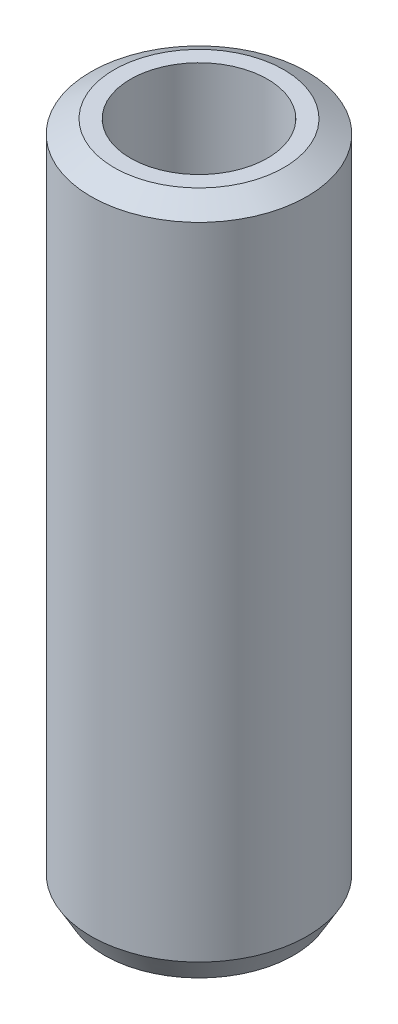
ISO-10303-21;
HEADER;
FILE_DESCRIPTION(('STEP AP214'),'2;1');
FILE_NAME('part.step','',(''),(''),'','','');
FILE_SCHEMA(('AUTOMOTIVE_DESIGN { 1 0 10303 214 1 1 1 1 }'));
ENDSEC;
DATA;
#1=APPLICATION_CONTEXT('core data for automotive mechanical design processes');
#2=APPLICATION_PROTOCOL_DEFINITION('international standard','automotive_design',2000,#1);
#3=PRODUCT_CONTEXT('',#1,'mechanical');
#4=PRODUCT('Part','Part','',(#3));
#5=PRODUCT_RELATED_PRODUCT_CATEGORY('part','',(#4));
#6=PRODUCT_DEFINITION_FORMATION('','',#4);
#7=PRODUCT_DEFINITION_CONTEXT('part definition',#1,'design');
#8=PRODUCT_DEFINITION('design','',#6,#7);
#9=PRODUCT_DEFINITION_SHAPE('','',#8);
#10=(LENGTH_UNIT() NAMED_UNIT(*) SI_UNIT(.MILLI.,.METRE.));
#11=(NAMED_UNIT(*) PLANE_ANGLE_UNIT() SI_UNIT($,.RADIAN.));
#12=(NAMED_UNIT(*) SI_UNIT($,.STERADIAN.) SOLID_ANGLE_UNIT());
#13=UNCERTAINTY_MEASURE_WITH_UNIT(LENGTH_MEASURE(1.E-05),#10,'distance_accuracy_value','');
#14=(GEOMETRIC_REPRESENTATION_CONTEXT(3) GLOBAL_UNCERTAINTY_ASSIGNED_CONTEXT((#13)) GLOBAL_UNIT_ASSIGNED_CONTEXT((#10,
#11,#12)) REPRESENTATION_CONTEXT('',''));
#15=CARTESIAN_POINT('',(0.,0.,0.));
#16=DIRECTION('',(0.,0.,1.));
#17=DIRECTION('',(1.,0.,0.));
#18=AXIS2_PLACEMENT_3D('',#15,#16,#17);
#19=CARTESIAN_POINT('',(0.,140.987925295457,0.));
#20=DIRECTION('',(0.,-1.,0.));
#21=DIRECTION('',(0.,0.,-1.));
#22=AXIS2_PLACEMENT_3D('',#19,#20,#21);
#23=CYLINDRICAL_SURFACE('',#22,22.5);
#24=CARTESIAN_POINT('',(0.,138.199197691897,0.));
#25=DIRECTION('',(0.,1.,0.));
#26=DIRECTION('',(0.,0.,1.));
#27=AXIS2_PLACEMENT_3D('',#24,#25,#26);
#28=CIRCLE('',#27,22.5);
#29=CARTESIAN_POINT('',(0.,138.199197691897,22.5));
#30=VERTEX_POINT('',#29);
#31=EDGE_CURVE('E50',#30,#30,#28,.F.);
#32=ORIENTED_EDGE('',*,*,#31,.T.);
#33=EDGE_LOOP('',(#32));
#34=FACE_BOUND('',#33,.T.);
#35=CARTESIAN_POINT('',(0.,4.83021789783569,0.));
#36=DIRECTION('',(0.,1.,0.));
#37=DIRECTION('',(0.,0.,1.));
#38=AXIS2_PLACEMENT_3D('',#35,#36,#37);
#39=CIRCLE('',#38,22.5);
#40=CARTESIAN_POINT('',(0.,4.83021789783569,22.5));
#41=VERTEX_POINT('',#40);
#42=EDGE_CURVE('E51',#41,#41,#39,.T.);
#43=ORIENTED_EDGE('',*,*,#42,.T.);
#44=EDGE_LOOP('',(#43));
#45=FACE_BOUND('',#44,.T.);
#46=ADVANCED_FACE('F39',(#34,#45),#23,.T.);
#47=CARTESIAN_POINT('',(0.,140.987925295457,0.));
#48=DIRECTION('',(0.,1.,0.));
#49=DIRECTION('',(0.,0.,1.));
#50=AXIS2_PLACEMENT_3D('',#47,#48,#49);
#51=PLANE('',#50);
#52=CARTESIAN_POINT('',(0.,140.987925295457,0.));
#53=DIRECTION('',(0.,1.,0.));
#54=DIRECTION('',(0.,0.,1.));
#55=AXIS2_PLACEMENT_3D('',#52,#53,#54);
#56=CIRCLE('',#55,17.6697821021644);
#57=CARTESIAN_POINT('',(0.,140.987925295457,17.6697821021644));
#58=VERTEX_POINT('',#57);
#59=EDGE_CURVE('E54',#58,#58,#56,.T.);
#60=ORIENTED_EDGE('',*,*,#59,.T.);
#61=EDGE_LOOP('',(#60));
#62=FACE_BOUND('',#61,.T.);
#63=CARTESIAN_POINT('',(0.,140.987925295457,0.));
#64=DIRECTION('',(0.,1.,0.));
#65=DIRECTION('',(0.,0.,1.));
#66=AXIS2_PLACEMENT_3D('',#63,#64,#65);
#67=CIRCLE('',#66,14.2602130310779);
#68=CARTESIAN_POINT('',(0.,140.987925295457,14.2602130310779));
#69=VERTEX_POINT('',#68);
#70=EDGE_CURVE('E58',#69,#69,#67,.T.);
#71=ORIENTED_EDGE('',*,*,#70,.F.);
#72=EDGE_LOOP('',(#71));
#73=FACE_BOUND('',#72,.T.);
#74=ADVANCED_FACE('F69',(#62,#73),#51,.T.);
#75=CARTESIAN_POINT('',(0.,0.,0.));
#76=DIRECTION('',(0.,1.,0.));
#77=DIRECTION('',(0.,0.,1.));
#78=AXIS2_PLACEMENT_3D('',#75,#76,#77);
#79=PLANE('',#78);
#80=CARTESIAN_POINT('',(0.,0.,0.));
#81=DIRECTION('',(0.,1.,0.));
#82=DIRECTION('',(0.,0.,1.));
#83=AXIS2_PLACEMENT_3D('',#80,#81,#82);
#84=CIRCLE('',#83,19.71127239644);
#85=CARTESIAN_POINT('',(0.,0.,19.71127239644));
#86=VERTEX_POINT('',#85);
#87=EDGE_CURVE('E10',#86,#86,#84,.F.);
#88=ORIENTED_EDGE('',*,*,#87,.T.);
#89=EDGE_LOOP('',(#88));
#90=FACE_BOUND('',#89,.T.);
#91=CARTESIAN_POINT('',(0.,0.,0.));
#92=DIRECTION('',(0.,1.,0.));
#93=DIRECTION('',(0.,0.,1.));
#94=AXIS2_PLACEMENT_3D('',#91,#92,#93);
#95=CIRCLE('',#94,14.2602130310779);
#96=CARTESIAN_POINT('',(0.,0.,14.2602130310779));
#97=VERTEX_POINT('',#96);
#98=EDGE_CURVE('E63',#97,#97,#95,.T.);
#99=ORIENTED_EDGE('',*,*,#98,.T.);
#100=EDGE_LOOP('',(#99));
#101=FACE_BOUND('',#100,.T.);
#102=ADVANCED_FACE('F75',(#90,#101),#79,.F.);
#103=CARTESIAN_POINT('',(0.,140.987925295457,0.));
#104=DIRECTION('',(0.,-1.,0.));
#105=DIRECTION('',(0.,0.,-1.));
#106=AXIS2_PLACEMENT_3D('',#103,#104,#105);
#107=CYLINDRICAL_SURFACE('',#106,14.2602130310779);
#108=ORIENTED_EDGE('',*,*,#70,.T.);
#109=EDGE_LOOP('',(#108));
#110=FACE_BOUND('',#109,.T.);
#111=ORIENTED_EDGE('',*,*,#98,.F.);
#112=EDGE_LOOP('',(#111));
#113=FACE_BOUND('',#112,.T.);
#114=ADVANCED_FACE('F70',(#110,#113),#107,.F.);
#115=CARTESIAN_POINT('',(0.,140.987925295457,0.));
#116=DIRECTION('',(0.,-1.,0.));
#117=DIRECTION('',(0.,0.,-1.));
#118=AXIS2_PLACEMENT_3D('',#115,#116,#117);
#119=CONICAL_SURFACE('',#118,17.6697821021644,1.04719755119659);
#120=ORIENTED_EDGE('',*,*,#31,.F.);
#121=EDGE_LOOP('',(#120));
#122=FACE_BOUND('',#121,.T.);
#123=ORIENTED_EDGE('',*,*,#59,.F.);
#124=EDGE_LOOP('',(#123));
#125=FACE_BOUND('',#124,.T.);
#126=ADVANCED_FACE('F81',(#122,#125),#119,.T.);
#127=CARTESIAN_POINT('',(0.,4.83021789783569,0.));
#128=DIRECTION('',(0.,1.,0.));
#129=DIRECTION('',(0.,0.,1.));
#130=AXIS2_PLACEMENT_3D('',#127,#128,#129);
#131=CONICAL_SURFACE('',#130,22.5,0.523598775598302);
#132=ORIENTED_EDGE('',*,*,#87,.F.);
#133=EDGE_LOOP('',(#132));
#134=FACE_BOUND('',#133,.T.);
#135=ORIENTED_EDGE('',*,*,#42,.F.);
#136=EDGE_LOOP('',(#135));
#137=FACE_BOUND('',#136,.T.);
#138=ADVANCED_FACE('F45',(#134,#137),#131,.T.);
#139=CLOSED_SHELL('',(#46,#74,#102,#114,#126,#138));
#140=MANIFOLD_SOLID_BREP('B2',#139);
#141=ADVANCED_BREP_SHAPE_REPRESENTATION('',(#18,#140),#14);
#142=SHAPE_DEFINITION_REPRESENTATION(#9,#141);
ENDSEC;
END-ISO-10303-21;
